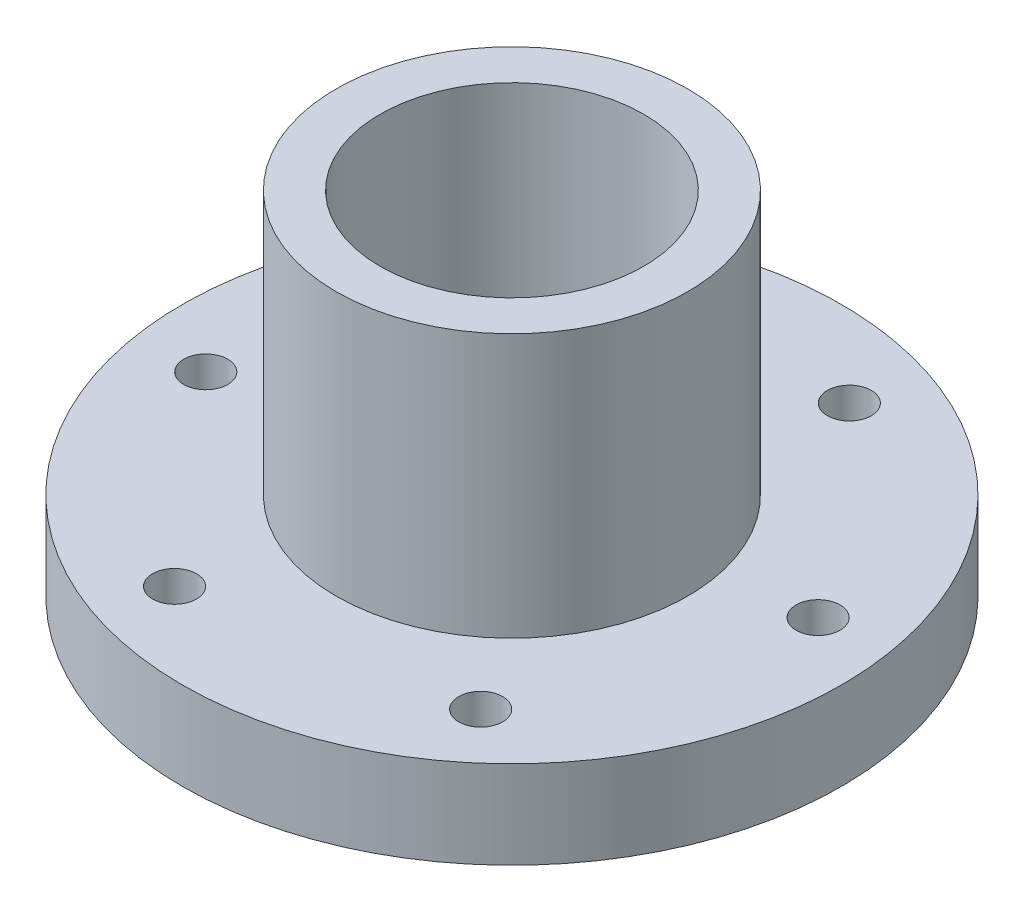
ISO-10303-21;
HEADER;
FILE_DESCRIPTION(('STEP AP214'),'2;1');
FILE_NAME('part.step','',(''),(''),'','','');
FILE_SCHEMA(('AUTOMOTIVE_DESIGN { 1 0 10303 214 1 1 1 1 }'));
ENDSEC;
DATA;
#1=APPLICATION_CONTEXT('core data for automotive mechanical design processes');
#2=APPLICATION_PROTOCOL_DEFINITION('international standard','automotive_design',2000,#1);
#3=PRODUCT_CONTEXT('',#1,'mechanical');
#4=PRODUCT('Part','Part','',(#3));
#5=PRODUCT_RELATED_PRODUCT_CATEGORY('part','',(#4));
#6=PRODUCT_DEFINITION_FORMATION('','',#4);
#7=PRODUCT_DEFINITION_CONTEXT('part definition',#1,'design');
#8=PRODUCT_DEFINITION('design','',#6,#7);
#9=PRODUCT_DEFINITION_SHAPE('','',#8);
#10=(LENGTH_UNIT() NAMED_UNIT(*) SI_UNIT(.MILLI.,.METRE.));
#11=(NAMED_UNIT(*) PLANE_ANGLE_UNIT() SI_UNIT($,.RADIAN.));
#12=(NAMED_UNIT(*) SI_UNIT($,.STERADIAN.) SOLID_ANGLE_UNIT());
#13=UNCERTAINTY_MEASURE_WITH_UNIT(LENGTH_MEASURE(1.E-05),#10,'distance_accuracy_value','');
#14=(GEOMETRIC_REPRESENTATION_CONTEXT(3) GLOBAL_UNCERTAINTY_ASSIGNED_CONTEXT((#13)) GLOBAL_UNIT_ASSIGNED_CONTEXT((#10,
#11,#12)) REPRESENTATION_CONTEXT('',''));
#15=CARTESIAN_POINT('',(0.,0.,0.));
#16=DIRECTION('',(0.,0.,1.));
#17=DIRECTION('',(1.,0.,0.));
#18=AXIS2_PLACEMENT_3D('',#15,#16,#17);
#19=CARTESIAN_POINT('',(0.150394736842101,-4.87947368421052,0.));
#20=DIRECTION('',(0.,-1.,0.));
#21=DIRECTION('',(0.,0.,-1.));
#22=AXIS2_PLACEMENT_3D('',#19,#20,#21);
#23=PLANE('',#22);
#24=CARTESIAN_POINT('',(3.22089998806195,-4.87947368421052,17.9232250875218));
#25=DIRECTION('',(0.,1.,0.));
#26=DIRECTION('',(0.,0.,1.));
#27=AXIS2_PLACEMENT_3D('',#24,#25,#26);
#28=CIRCLE('',#27,1.58749999999999);
#29=CARTESIAN_POINT('',(3.22089998806195,-4.87947368421052,19.5107250875218));
#30=VERTEX_POINT('',#29);
#31=EDGE_CURVE('E87',#30,#30,#28,.T.);
#32=ORIENTED_EDGE('',*,*,#31,.T.);
#33=EDGE_LOOP('',(#32));
#34=FACE_BOUND('',#33,.T.);
#35=CARTESIAN_POINT('',(-9.0738208810884,-4.87947368421052,3.37185612272397));
#36=DIRECTION('',(0.,1.,0.));
#37=DIRECTION('',(0.,0.,1.));
#38=AXIS2_PLACEMENT_3D('',#35,#36,#37);
#39=CIRCLE('',#38,1.58749999999999);
#40=CARTESIAN_POINT('',(-9.0738208810884,-4.87947368421052,4.95935612272396));
#41=VERTEX_POINT('',#40);
#42=EDGE_CURVE('E81',#41,#41,#39,.T.);
#43=ORIENTED_EDGE('',*,*,#42,.T.);
#44=EDGE_LOOP('',(#43));
#45=FACE_BOUND('',#44,.T.);
#46=CARTESIAN_POINT('',(-2.61932613230818,-4.87947368421052,-14.5513689647978));
#47=DIRECTION('',(0.,1.,0.));
#48=DIRECTION('',(0.,0.,1.));
#49=AXIS2_PLACEMENT_3D('',#46,#47,#48);
#50=CIRCLE('',#49,1.58749999999999);
#51=CARTESIAN_POINT('',(-2.61932613230818,-4.87947368421052,-12.9638689647978));
#52=VERTEX_POINT('',#51);
#53=EDGE_CURVE('E75',#52,#52,#50,.T.);
#54=ORIENTED_EDGE('',*,*,#53,.T.);
#55=EDGE_LOOP('',(#54));
#56=FACE_BOUND('',#55,.T.);
#57=CARTESIAN_POINT('',(16.1298894856224,-4.87947368421052,-17.9232250875217));
#58=DIRECTION('',(0.,1.,0.));
#59=DIRECTION('',(0.,0.,1.));
#60=AXIS2_PLACEMENT_3D('',#57,#58,#59);
#61=CIRCLE('',#60,1.58749999999999);
#62=CARTESIAN_POINT('',(16.1298894856224,-4.87947368421052,-16.3357250875217));
#63=VERTEX_POINT('',#62);
#64=EDGE_CURVE('E69',#63,#63,#61,.T.);
#65=ORIENTED_EDGE('',*,*,#64,.T.);
#66=EDGE_LOOP('',(#65));
#67=FACE_BOUND('',#66,.T.);
#68=CARTESIAN_POINT('',(28.4246103547726,-4.87947368421052,-3.37185612272384));
#69=DIRECTION('',(0.,1.,0.));
#70=DIRECTION('',(0.,0.,1.));
#71=AXIS2_PLACEMENT_3D('',#68,#69,#70);
#72=CIRCLE('',#71,1.58749999999999);
#73=CARTESIAN_POINT('',(28.4246103547726,-4.87947368421052,-1.78435612272386));
#74=VERTEX_POINT('',#73);
#75=EDGE_CURVE('E63',#74,#74,#72,.T.);
#76=ORIENTED_EDGE('',*,*,#75,.T.);
#77=EDGE_LOOP('',(#76));
#78=FACE_BOUND('',#77,.T.);
#79=CARTESIAN_POINT('',(9.6753947368421,-4.87947368421053,0.));
#80=DIRECTION('',(0.,1.,0.));
#81=DIRECTION('',(0.,0.,1.));
#82=AXIS2_PLACEMENT_3D('',#79,#80,#81);
#83=CIRCLE('',#82,23.8125);
#84=CARTESIAN_POINT('',(9.6753947368421,-4.87947368421053,23.8125));
#85=VERTEX_POINT('',#84);
#86=EDGE_CURVE('E54',#85,#85,#83,.T.);
#87=ORIENTED_EDGE('',*,*,#86,.F.);
#88=EDGE_LOOP('',(#87));
#89=FACE_BOUND('',#88,.T.);
#90=CARTESIAN_POINT('',(9.6753947368421,-4.87947368421052,0.));
#91=DIRECTION('',(0.,1.,0.));
#92=DIRECTION('',(0.,0.,1.));
#93=AXIS2_PLACEMENT_3D('',#90,#91,#92);
#94=CIRCLE('',#93,9.525);
#95=CARTESIAN_POINT('',(9.6753947368421,-4.87947368421052,9.525));
#96=VERTEX_POINT('',#95);
#97=EDGE_CURVE('E51',#96,#96,#94,.T.);
#98=ORIENTED_EDGE('',*,*,#97,.T.);
#99=EDGE_LOOP('',(#98));
#100=FACE_BOUND('',#99,.T.);
#101=CARTESIAN_POINT('',(21.9701156059923,-4.87947368421052,14.5513689647979));
#102=DIRECTION('',(0.,1.,0.));
#103=DIRECTION('',(0.,0.,1.));
#104=AXIS2_PLACEMENT_3D('',#101,#102,#103);
#105=CIRCLE('',#104,1.58749999999999);
#106=CARTESIAN_POINT('',(21.9701156059923,-4.87947368421052,16.1388689647979));
#107=VERTEX_POINT('',#106);
#108=EDGE_CURVE('E57',#107,#107,#105,.T.);
#109=ORIENTED_EDGE('',*,*,#108,.T.);
#110=EDGE_LOOP('',(#109));
#111=FACE_BOUND('',#110,.T.);
#112=ADVANCED_FACE('F31',(#34,#45,#56,#67,#78,#89,#100,#111),#23,.T.);
#113=CARTESIAN_POINT('',(9.6753947368421,1.47052631578947,0.));
#114=DIRECTION('',(0.,1.,0.));
#115=DIRECTION('',(0.,0.,1.));
#116=AXIS2_PLACEMENT_3D('',#113,#114,#115);
#117=CYLINDRICAL_SURFACE('',#116,23.8125);
#118=ORIENTED_EDGE('',*,*,#86,.T.);
#119=EDGE_LOOP('',(#118));
#120=FACE_BOUND('',#119,.T.);
#121=CARTESIAN_POINT('',(9.6753947368421,1.47052631578947,0.));
#122=DIRECTION('',(0.,1.,0.));
#123=DIRECTION('',(0.,0.,1.));
#124=AXIS2_PLACEMENT_3D('',#121,#122,#123);
#125=CIRCLE('',#124,23.8125);
#126=CARTESIAN_POINT('',(9.6753947368421,1.47052631578947,23.8125));
#127=VERTEX_POINT('',#126);
#128=EDGE_CURVE('E10',#127,#127,#125,.T.);
#129=ORIENTED_EDGE('',*,*,#128,.F.);
#130=EDGE_LOOP('',(#129));
#131=FACE_BOUND('',#130,.T.);
#132=ADVANCED_FACE('F33',(#120,#131),#117,.T.);
#133=CARTESIAN_POINT('',(-14.1371052631579,1.47052631578947,0.));
#134=DIRECTION('',(0.,1.,0.));
#135=DIRECTION('',(0.,0.,1.));
#136=AXIS2_PLACEMENT_3D('',#133,#134,#135);
#137=PLANE('',#136);
#138=CARTESIAN_POINT('',(3.22089998806195,1.47052631578947,17.9232250875218));
#139=DIRECTION('',(0.,1.,0.));
#140=DIRECTION('',(0.,0.,1.));
#141=AXIS2_PLACEMENT_3D('',#138,#139,#140);
#142=CIRCLE('',#141,1.58749999999999);
#143=CARTESIAN_POINT('',(3.22089998806195,1.47052631578947,19.5107250875218));
#144=VERTEX_POINT('',#143);
#145=EDGE_CURVE('E90',#144,#144,#142,.T.);
#146=ORIENTED_EDGE('',*,*,#145,.F.);
#147=EDGE_LOOP('',(#146));
#148=FACE_BOUND('',#147,.T.);
#149=CARTESIAN_POINT('',(-9.0738208810884,1.47052631578947,3.37185612272397));
#150=DIRECTION('',(0.,1.,0.));
#151=DIRECTION('',(0.,0.,1.));
#152=AXIS2_PLACEMENT_3D('',#149,#150,#151);
#153=CIRCLE('',#152,1.58749999999999);
#154=CARTESIAN_POINT('',(-9.0738208810884,1.47052631578947,4.95935612272396));
#155=VERTEX_POINT('',#154);
#156=EDGE_CURVE('E84',#155,#155,#153,.T.);
#157=ORIENTED_EDGE('',*,*,#156,.F.);
#158=EDGE_LOOP('',(#157));
#159=FACE_BOUND('',#158,.T.);
#160=CARTESIAN_POINT('',(-2.61932613230818,1.47052631578947,-14.5513689647978));
#161=DIRECTION('',(0.,1.,0.));
#162=DIRECTION('',(0.,0.,1.));
#163=AXIS2_PLACEMENT_3D('',#160,#161,#162);
#164=CIRCLE('',#163,1.58749999999999);
#165=CARTESIAN_POINT('',(-2.61932613230818,1.47052631578947,-12.9638689647978));
#166=VERTEX_POINT('',#165);
#167=EDGE_CURVE('E78',#166,#166,#164,.T.);
#168=ORIENTED_EDGE('',*,*,#167,.F.);
#169=EDGE_LOOP('',(#168));
#170=FACE_BOUND('',#169,.T.);
#171=CARTESIAN_POINT('',(16.1298894856224,1.47052631578947,-17.9232250875217));
#172=DIRECTION('',(0.,1.,0.));
#173=DIRECTION('',(0.,0.,1.));
#174=AXIS2_PLACEMENT_3D('',#171,#172,#173);
#175=CIRCLE('',#174,1.58749999999999);
#176=CARTESIAN_POINT('',(16.1298894856224,1.47052631578947,-16.3357250875217));
#177=VERTEX_POINT('',#176);
#178=EDGE_CURVE('E72',#177,#177,#175,.T.);
#179=ORIENTED_EDGE('',*,*,#178,.F.);
#180=EDGE_LOOP('',(#179));
#181=FACE_BOUND('',#180,.T.);
#182=CARTESIAN_POINT('',(28.4246103547726,1.47052631578947,-3.37185612272384));
#183=DIRECTION('',(0.,1.,0.));
#184=DIRECTION('',(0.,0.,1.));
#185=AXIS2_PLACEMENT_3D('',#182,#183,#184);
#186=CIRCLE('',#185,1.58749999999999);
#187=CARTESIAN_POINT('',(28.4246103547726,1.47052631578947,-1.78435612272385));
#188=VERTEX_POINT('',#187);
#189=EDGE_CURVE('E66',#188,#188,#186,.T.);
#190=ORIENTED_EDGE('',*,*,#189,.F.);
#191=EDGE_LOOP('',(#190));
#192=FACE_BOUND('',#191,.T.);
#193=CARTESIAN_POINT('',(21.9701156059923,1.47052631578947,14.5513689647979));
#194=DIRECTION('',(0.,1.,0.));
#195=DIRECTION('',(0.,0.,1.));
#196=AXIS2_PLACEMENT_3D('',#193,#194,#195);
#197=CIRCLE('',#196,1.58749999999999);
#198=CARTESIAN_POINT('',(21.9701156059923,1.47052631578947,16.1388689647979));
#199=VERTEX_POINT('',#198);
#200=EDGE_CURVE('E60',#199,#199,#197,.T.);
#201=ORIENTED_EDGE('',*,*,#200,.F.);
#202=EDGE_LOOP('',(#201));
#203=FACE_BOUND('',#202,.T.);
#204=ORIENTED_EDGE('',*,*,#128,.T.);
#205=EDGE_LOOP('',(#204));
#206=FACE_BOUND('',#205,.T.);
#207=CARTESIAN_POINT('',(9.6753947368421,1.47052631578947,0.));
#208=DIRECTION('',(0.,1.,0.));
#209=DIRECTION('',(0.,0.,1.));
#210=AXIS2_PLACEMENT_3D('',#207,#208,#209);
#211=CIRCLE('',#210,12.7);
#212=CARTESIAN_POINT('',(9.6753947368421,1.47052631578947,12.7));
#213=VERTEX_POINT('',#212);
#214=EDGE_CURVE('E38',#213,#213,#211,.T.);
#215=ORIENTED_EDGE('',*,*,#214,.F.);
#216=EDGE_LOOP('',(#215));
#217=FACE_BOUND('',#216,.T.);
#218=ADVANCED_FACE('F96',(#148,#159,#170,#181,#192,#203,#206,#217),#137,.T.);
#219=CARTESIAN_POINT('',(9.6753947368421,1.47052631578947,0.));
#220=DIRECTION('',(0.,1.,0.));
#221=DIRECTION('',(0.,0.,1.));
#222=AXIS2_PLACEMENT_3D('',#219,#220,#221);
#223=CYLINDRICAL_SURFACE('',#222,12.7);
#224=ORIENTED_EDGE('',*,*,#214,.T.);
#225=EDGE_LOOP('',(#224));
#226=FACE_BOUND('',#225,.T.);
#227=CARTESIAN_POINT('',(9.6753947368421,20.5205263157895,0.));
#228=DIRECTION('',(0.,1.,0.));
#229=DIRECTION('',(0.,0.,1.));
#230=AXIS2_PLACEMENT_3D('',#227,#228,#229);
#231=CIRCLE('',#230,12.7);
#232=CARTESIAN_POINT('',(9.6753947368421,20.5205263157895,12.7));
#233=VERTEX_POINT('',#232);
#234=EDGE_CURVE('E42',#233,#233,#231,.T.);
#235=ORIENTED_EDGE('',*,*,#234,.F.);
#236=EDGE_LOOP('',(#235));
#237=FACE_BOUND('',#236,.T.);
#238=ADVANCED_FACE('F99',(#226,#237),#223,.T.);
#239=CARTESIAN_POINT('',(-3.0246052631579,20.5205263157895,0.));
#240=DIRECTION('',(0.,1.,0.));
#241=DIRECTION('',(0.,0.,1.));
#242=AXIS2_PLACEMENT_3D('',#239,#240,#241);
#243=PLANE('',#242);
#244=ORIENTED_EDGE('',*,*,#234,.T.);
#245=EDGE_LOOP('',(#244));
#246=FACE_BOUND('',#245,.T.);
#247=CARTESIAN_POINT('',(9.6753947368421,20.5205263157895,0.));
#248=DIRECTION('',(0.,1.,0.));
#249=DIRECTION('',(0.,0.,1.));
#250=AXIS2_PLACEMENT_3D('',#247,#248,#249);
#251=CIRCLE('',#250,9.525);
#252=CARTESIAN_POINT('',(9.6753947368421,20.5205263157895,9.525));
#253=VERTEX_POINT('',#252);
#254=EDGE_CURVE('E46',#253,#253,#251,.T.);
#255=ORIENTED_EDGE('',*,*,#254,.F.);
#256=EDGE_LOOP('',(#255));
#257=FACE_BOUND('',#256,.T.);
#258=ADVANCED_FACE('F124',(#246,#257),#243,.T.);
#259=CARTESIAN_POINT('',(9.6753947368421,1.47052631578947,0.));
#260=DIRECTION('',(0.,1.,0.));
#261=DIRECTION('',(0.,0.,1.));
#262=AXIS2_PLACEMENT_3D('',#259,#260,#261);
#263=CYLINDRICAL_SURFACE('',#262,9.525);
#264=ORIENTED_EDGE('',*,*,#254,.T.);
#265=EDGE_LOOP('',(#264));
#266=FACE_BOUND('',#265,.T.);
#267=ORIENTED_EDGE('',*,*,#97,.F.);
#268=EDGE_LOOP('',(#267));
#269=FACE_BOUND('',#268,.T.);
#270=ADVANCED_FACE('F114',(#266,#269),#263,.F.);
#271=CARTESIAN_POINT('',(21.9701156059923,1.47052631578947,14.5513689647979));
#272=DIRECTION('',(0.,1.,0.));
#273=DIRECTION('',(0.,0.,1.));
#274=AXIS2_PLACEMENT_3D('',#271,#272,#273);
#275=CYLINDRICAL_SURFACE('',#274,1.58749999999999);
#276=ORIENTED_EDGE('',*,*,#108,.F.);
#277=EDGE_LOOP('',(#276));
#278=FACE_BOUND('',#277,.T.);
#279=ORIENTED_EDGE('',*,*,#200,.T.);
#280=EDGE_LOOP('',(#279));
#281=FACE_BOUND('',#280,.T.);
#282=ADVANCED_FACE('F111',(#278,#281),#275,.F.);
#283=CARTESIAN_POINT('',(28.4246103547726,1.47052631578947,-3.37185612272384));
#284=DIRECTION('',(0.,1.,0.));
#285=DIRECTION('',(0.,0.,1.));
#286=AXIS2_PLACEMENT_3D('',#283,#284,#285);
#287=CYLINDRICAL_SURFACE('',#286,1.58749999999999);
#288=ORIENTED_EDGE('',*,*,#75,.F.);
#289=EDGE_LOOP('',(#288));
#290=FACE_BOUND('',#289,.T.);
#291=ORIENTED_EDGE('',*,*,#189,.T.);
#292=EDGE_LOOP('',(#291));
#293=FACE_BOUND('',#292,.T.);
#294=ADVANCED_FACE('F113',(#290,#293),#287,.F.);
#295=CARTESIAN_POINT('',(16.1298894856224,1.47052631578947,-17.9232250875217));
#296=DIRECTION('',(0.,1.,0.));
#297=DIRECTION('',(0.,0.,1.));
#298=AXIS2_PLACEMENT_3D('',#295,#296,#297);
#299=CYLINDRICAL_SURFACE('',#298,1.58749999999999);
#300=ORIENTED_EDGE('',*,*,#64,.F.);
#301=EDGE_LOOP('',(#300));
#302=FACE_BOUND('',#301,.T.);
#303=ORIENTED_EDGE('',*,*,#178,.T.);
#304=EDGE_LOOP('',(#303));
#305=FACE_BOUND('',#304,.T.);
#306=ADVANCED_FACE('F121',(#302,#305),#299,.F.);
#307=CARTESIAN_POINT('',(-2.61932613230818,1.47052631578947,-14.5513689647978));
#308=DIRECTION('',(0.,1.,0.));
#309=DIRECTION('',(0.,0.,1.));
#310=AXIS2_PLACEMENT_3D('',#307,#308,#309);
#311=CYLINDRICAL_SURFACE('',#310,1.58749999999999);
#312=ORIENTED_EDGE('',*,*,#53,.F.);
#313=EDGE_LOOP('',(#312));
#314=FACE_BOUND('',#313,.T.);
#315=ORIENTED_EDGE('',*,*,#167,.T.);
#316=EDGE_LOOP('',(#315));
#317=FACE_BOUND('',#316,.T.);
#318=ADVANCED_FACE('F190',(#314,#317),#311,.F.);
#319=CARTESIAN_POINT('',(-9.0738208810884,1.47052631578947,3.37185612272397));
#320=DIRECTION('',(0.,1.,0.));
#321=DIRECTION('',(0.,0.,1.));
#322=AXIS2_PLACEMENT_3D('',#319,#320,#321);
#323=CYLINDRICAL_SURFACE('',#322,1.58749999999999);
#324=ORIENTED_EDGE('',*,*,#42,.F.);
#325=EDGE_LOOP('',(#324));
#326=FACE_BOUND('',#325,.T.);
#327=ORIENTED_EDGE('',*,*,#156,.T.);
#328=EDGE_LOOP('',(#327));
#329=FACE_BOUND('',#328,.T.);
#330=ADVANCED_FACE('F200',(#326,#329),#323,.F.);
#331=CARTESIAN_POINT('',(3.22089998806195,1.47052631578947,17.9232250875218));
#332=DIRECTION('',(0.,1.,0.));
#333=DIRECTION('',(0.,0.,1.));
#334=AXIS2_PLACEMENT_3D('',#331,#332,#333);
#335=CYLINDRICAL_SURFACE('',#334,1.58749999999999);
#336=ORIENTED_EDGE('',*,*,#31,.F.);
#337=EDGE_LOOP('',(#336));
#338=FACE_BOUND('',#337,.T.);
#339=ORIENTED_EDGE('',*,*,#145,.T.);
#340=EDGE_LOOP('',(#339));
#341=FACE_BOUND('',#340,.T.);
#342=ADVANCED_FACE('F94',(#338,#341),#335,.F.);
#343=CLOSED_SHELL('',(#112,#132,#218,#238,#258,#270,#282,#294,#306,#318,#330,#342));
#344=MANIFOLD_SOLID_BREP('B2',#343);
#345=ADVANCED_BREP_SHAPE_REPRESENTATION('',(#18,#344),#14);
#346=SHAPE_DEFINITION_REPRESENTATION(#9,#345);
ENDSEC;
END-ISO-10303-21;
